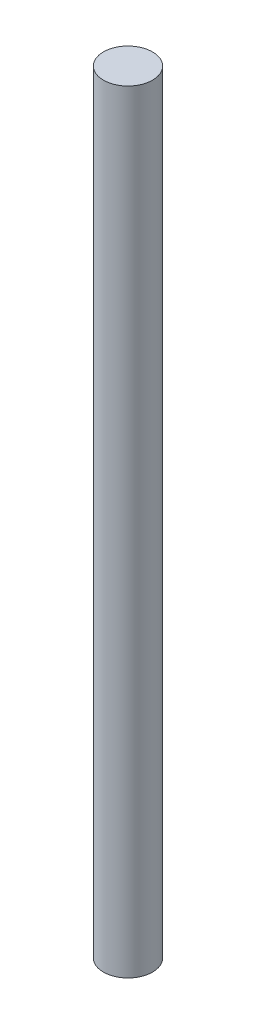
ISO-10303-21;
HEADER;
FILE_DESCRIPTION(('STEP AP214'),'2;1');
FILE_NAME('part.step','',(''),(''),'','','');
FILE_SCHEMA(('AUTOMOTIVE_DESIGN { 1 0 10303 214 1 1 1 1 }'));
ENDSEC;
DATA;
#1=APPLICATION_CONTEXT('core data for automotive mechanical design processes');
#2=APPLICATION_PROTOCOL_DEFINITION('international standard','automotive_design',2000,#1);
#3=PRODUCT_CONTEXT('',#1,'mechanical');
#4=PRODUCT('Part','Part','',(#3));
#5=PRODUCT_RELATED_PRODUCT_CATEGORY('part','',(#4));
#6=PRODUCT_DEFINITION_FORMATION('','',#4);
#7=PRODUCT_DEFINITION_CONTEXT('part definition',#1,'design');
#8=PRODUCT_DEFINITION('design','',#6,#7);
#9=PRODUCT_DEFINITION_SHAPE('','',#8);
#10=(LENGTH_UNIT() NAMED_UNIT(*) SI_UNIT(.MILLI.,.METRE.));
#11=(NAMED_UNIT(*) PLANE_ANGLE_UNIT() SI_UNIT($,.RADIAN.));
#12=(NAMED_UNIT(*) SI_UNIT($,.STERADIAN.) SOLID_ANGLE_UNIT());
#13=UNCERTAINTY_MEASURE_WITH_UNIT(LENGTH_MEASURE(1.E-05),#10,'distance_accuracy_value','');
#14=(GEOMETRIC_REPRESENTATION_CONTEXT(3) GLOBAL_UNCERTAINTY_ASSIGNED_CONTEXT((#13)) GLOBAL_UNIT_ASSIGNED_CONTEXT((#10,
#11,#12)) REPRESENTATION_CONTEXT('',''));
#15=CARTESIAN_POINT('',(0.,0.,0.));
#16=DIRECTION('',(0.,0.,1.));
#17=DIRECTION('',(1.,0.,0.));
#18=AXIS2_PLACEMENT_3D('',#15,#16,#17);
#19=CARTESIAN_POINT('',(0.,100.,0.));
#20=DIRECTION('',(0.,-1.,0.));
#21=DIRECTION('',(0.,0.,-1.));
#22=AXIS2_PLACEMENT_3D('',#19,#20,#21);
#23=CYLINDRICAL_SURFACE('',#22,3.175);
#24=CARTESIAN_POINT('',(0.,100.,0.));
#25=DIRECTION('',(0.,1.,0.));
#26=DIRECTION('',(0.,0.,1.));
#27=AXIS2_PLACEMENT_3D('',#24,#25,#26);
#28=CIRCLE('',#27,3.175);
#29=CARTESIAN_POINT('',(0.,100.,3.175));
#30=VERTEX_POINT('',#29);
#31=EDGE_CURVE('E10',#30,#30,#28,.T.);
#32=ORIENTED_EDGE('',*,*,#31,.F.);
#33=EDGE_LOOP('',(#32));
#34=FACE_BOUND('',#33,.T.);
#35=CARTESIAN_POINT('',(0.,0.,0.));
#36=DIRECTION('',(0.,1.,0.));
#37=DIRECTION('',(0.,0.,1.));
#38=AXIS2_PLACEMENT_3D('',#35,#36,#37);
#39=CIRCLE('',#38,3.175);
#40=CARTESIAN_POINT('',(0.,0.,3.175));
#41=VERTEX_POINT('',#40);
#42=EDGE_CURVE('E37',#41,#41,#39,.T.);
#43=ORIENTED_EDGE('',*,*,#42,.T.);
#44=EDGE_LOOP('',(#43));
#45=FACE_BOUND('',#44,.T.);
#46=ADVANCED_FACE('F34',(#34,#45),#23,.T.);
#47=CARTESIAN_POINT('',(0.,100.,0.));
#48=DIRECTION('',(0.,1.,0.));
#49=DIRECTION('',(0.,0.,1.));
#50=AXIS2_PLACEMENT_3D('',#47,#48,#49);
#51=PLANE('',#50);
#52=ORIENTED_EDGE('',*,*,#31,.T.);
#53=EDGE_LOOP('',(#52));
#54=FACE_BOUND('',#53,.T.);
#55=ADVANCED_FACE('F49',(#54),#51,.T.);
#56=CARTESIAN_POINT('',(0.,0.,0.));
#57=DIRECTION('',(0.,1.,0.));
#58=DIRECTION('',(0.,0.,1.));
#59=AXIS2_PLACEMENT_3D('',#56,#57,#58);
#60=PLANE('',#59);
#61=ORIENTED_EDGE('',*,*,#42,.F.);
#62=EDGE_LOOP('',(#61));
#63=FACE_BOUND('',#62,.T.);
#64=ADVANCED_FACE('F47',(#63),#60,.F.);
#65=CLOSED_SHELL('',(#46,#55,#64));
#66=MANIFOLD_SOLID_BREP('B2',#65);
#67=ADVANCED_BREP_SHAPE_REPRESENTATION('',(#18,#66),#14);
#68=SHAPE_DEFINITION_REPRESENTATION(#9,#67);
ENDSEC;
END-ISO-10303-21;
